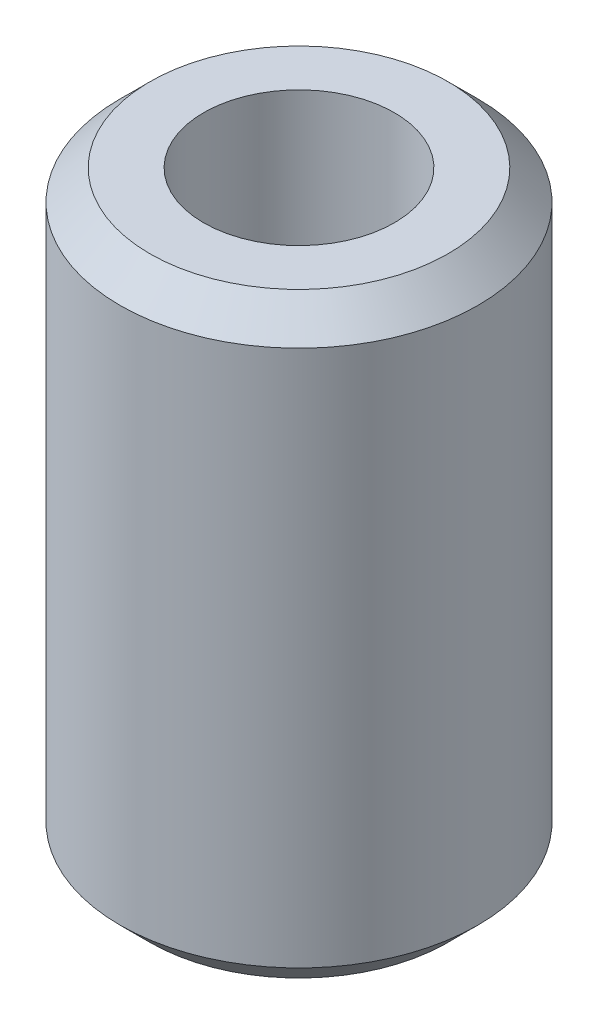
ISO-10303-21;
HEADER;
FILE_DESCRIPTION(('STEP AP214'),'2;1');
FILE_NAME('part.step','',(''),(''),'','','');
FILE_SCHEMA(('AUTOMOTIVE_DESIGN { 1 0 10303 214 1 1 1 1 }'));
ENDSEC;
DATA;
#1=APPLICATION_CONTEXT('core data for automotive mechanical design processes');
#2=APPLICATION_PROTOCOL_DEFINITION('international standard','automotive_design',2000,#1);
#3=PRODUCT_CONTEXT('',#1,'mechanical');
#4=PRODUCT('Part','Part','',(#3));
#5=PRODUCT_RELATED_PRODUCT_CATEGORY('part','',(#4));
#6=PRODUCT_DEFINITION_FORMATION('','',#4);
#7=PRODUCT_DEFINITION_CONTEXT('part definition',#1,'design');
#8=PRODUCT_DEFINITION('design','',#6,#7);
#9=PRODUCT_DEFINITION_SHAPE('','',#8);
#10=(LENGTH_UNIT() NAMED_UNIT(*) SI_UNIT(.MILLI.,.METRE.));
#11=(NAMED_UNIT(*) PLANE_ANGLE_UNIT() SI_UNIT($,.RADIAN.));
#12=(NAMED_UNIT(*) SI_UNIT($,.STERADIAN.) SOLID_ANGLE_UNIT());
#13=UNCERTAINTY_MEASURE_WITH_UNIT(LENGTH_MEASURE(1.E-05),#10,'distance_accuracy_value','');
#14=(GEOMETRIC_REPRESENTATION_CONTEXT(3) GLOBAL_UNCERTAINTY_ASSIGNED_CONTEXT((#13)) GLOBAL_UNIT_ASSIGNED_CONTEXT((#10,
#11,#12)) REPRESENTATION_CONTEXT('',''));
#15=CARTESIAN_POINT('',(0.,0.,0.));
#16=DIRECTION('',(0.,0.,1.));
#17=DIRECTION('',(1.,0.,0.));
#18=AXIS2_PLACEMENT_3D('',#15,#16,#17);
#19=CARTESIAN_POINT('',(0.,10.,0.));
#20=DIRECTION('',(0.,-1.,0.));
#21=DIRECTION('',(0.,0.,-1.));
#22=AXIS2_PLACEMENT_3D('',#19,#20,#21);
#23=CYLINDRICAL_SURFACE('',#22,3.);
#24=CARTESIAN_POINT('',(0.,0.499999999999999,0.));
#25=DIRECTION('',(0.,1.,0.));
#26=DIRECTION('',(0.,0.,1.));
#27=AXIS2_PLACEMENT_3D('',#24,#25,#26);
#28=CIRCLE('',#27,3.);
#29=CARTESIAN_POINT('',(0.,0.499999999999999,3.));
#30=VERTEX_POINT('',#29);
#31=EDGE_CURVE('E42',#30,#30,#28,.T.);
#32=ORIENTED_EDGE('',*,*,#31,.T.);
#33=EDGE_LOOP('',(#32));
#34=FACE_BOUND('',#33,.T.);
#35=CARTESIAN_POINT('',(0.,9.5,0.));
#36=DIRECTION('',(0.,1.,0.));
#37=DIRECTION('',(0.,0.,1.));
#38=AXIS2_PLACEMENT_3D('',#35,#36,#37);
#39=CIRCLE('',#38,3.);
#40=CARTESIAN_POINT('',(0.,9.5,3.));
#41=VERTEX_POINT('',#40);
#42=EDGE_CURVE('E46',#41,#41,#39,.F.);
#43=ORIENTED_EDGE('',*,*,#42,.T.);
#44=EDGE_LOOP('',(#43));
#45=FACE_BOUND('',#44,.T.);
#46=ADVANCED_FACE('F31',(#34,#45),#23,.T.);
#47=CARTESIAN_POINT('',(0.,10.,0.));
#48=DIRECTION('',(0.,1.,0.));
#49=DIRECTION('',(0.,0.,1.));
#50=AXIS2_PLACEMENT_3D('',#47,#48,#49);
#51=PLANE('',#50);
#52=CARTESIAN_POINT('',(0.,10.,0.));
#53=DIRECTION('',(0.,1.,0.));
#54=DIRECTION('',(0.,0.,1.));
#55=AXIS2_PLACEMENT_3D('',#52,#53,#54);
#56=CIRCLE('',#55,2.5);
#57=CARTESIAN_POINT('',(0.,10.,2.5));
#58=VERTEX_POINT('',#57);
#59=EDGE_CURVE('E10',#58,#58,#56,.T.);
#60=ORIENTED_EDGE('',*,*,#59,.T.);
#61=EDGE_LOOP('',(#60));
#62=FACE_BOUND('',#61,.T.);
#63=CARTESIAN_POINT('',(0.,10.,0.));
#64=DIRECTION('',(0.,1.,0.));
#65=DIRECTION('',(0.,0.,1.));
#66=AXIS2_PLACEMENT_3D('',#63,#64,#65);
#67=CIRCLE('',#66,1.6);
#68=CARTESIAN_POINT('',(0.,10.,1.6));
#69=VERTEX_POINT('',#68);
#70=EDGE_CURVE('E52',#69,#69,#67,.T.);
#71=ORIENTED_EDGE('',*,*,#70,.F.);
#72=EDGE_LOOP('',(#71));
#73=FACE_BOUND('',#72,.T.);
#74=ADVANCED_FACE('F67',(#62,#73),#51,.T.);
#75=CARTESIAN_POINT('',(0.,0.,0.));
#76=DIRECTION('',(0.,1.,0.));
#77=DIRECTION('',(0.,0.,1.));
#78=AXIS2_PLACEMENT_3D('',#75,#76,#77);
#79=PLANE('',#78);
#80=CARTESIAN_POINT('',(0.,0.,0.));
#81=DIRECTION('',(0.,1.,0.));
#82=DIRECTION('',(0.,0.,1.));
#83=AXIS2_PLACEMENT_3D('',#80,#81,#82);
#84=CIRCLE('',#83,2.5);
#85=CARTESIAN_POINT('',(0.,0.,2.5));
#86=VERTEX_POINT('',#85);
#87=EDGE_CURVE('E38',#86,#86,#84,.F.);
#88=ORIENTED_EDGE('',*,*,#87,.T.);
#89=EDGE_LOOP('',(#88));
#90=FACE_BOUND('',#89,.T.);
#91=CARTESIAN_POINT('',(0.,0.,0.));
#92=DIRECTION('',(0.,1.,0.));
#93=DIRECTION('',(0.,0.,1.));
#94=AXIS2_PLACEMENT_3D('',#91,#92,#93);
#95=CIRCLE('',#94,1.6);
#96=CARTESIAN_POINT('',(0.,0.,1.6));
#97=VERTEX_POINT('',#96);
#98=EDGE_CURVE('E51',#97,#97,#95,.T.);
#99=ORIENTED_EDGE('',*,*,#98,.T.);
#100=EDGE_LOOP('',(#99));
#101=FACE_BOUND('',#100,.T.);
#102=ADVANCED_FACE('F58',(#90,#101),#79,.F.);
#103=CARTESIAN_POINT('',(0.,0.,0.));
#104=DIRECTION('',(0.,1.,0.));
#105=DIRECTION('',(0.,0.,1.));
#106=AXIS2_PLACEMENT_3D('',#103,#104,#105);
#107=CYLINDRICAL_SURFACE('',#106,1.6);
#108=ORIENTED_EDGE('',*,*,#98,.F.);
#109=EDGE_LOOP('',(#108));
#110=FACE_BOUND('',#109,.T.);
#111=ORIENTED_EDGE('',*,*,#70,.T.);
#112=EDGE_LOOP('',(#111));
#113=FACE_BOUND('',#112,.T.);
#114=ADVANCED_FACE('F60',(#110,#113),#107,.F.);
#115=CARTESIAN_POINT('',(0.,0.499999999999999,0.));
#116=DIRECTION('',(0.,1.,0.));
#117=DIRECTION('',(0.,0.,1.));
#118=AXIS2_PLACEMENT_3D('',#115,#116,#117);
#119=CONICAL_SURFACE('',#118,3.,0.785398163397451);
#120=ORIENTED_EDGE('',*,*,#87,.F.);
#121=EDGE_LOOP('',(#120));
#122=FACE_BOUND('',#121,.T.);
#123=ORIENTED_EDGE('',*,*,#31,.F.);
#124=EDGE_LOOP('',(#123));
#125=FACE_BOUND('',#124,.T.);
#126=ADVANCED_FACE('F63',(#122,#125),#119,.T.);
#127=CARTESIAN_POINT('',(0.,10.,0.));
#128=DIRECTION('',(0.,-1.,0.));
#129=DIRECTION('',(0.,0.,-1.));
#130=AXIS2_PLACEMENT_3D('',#127,#128,#129);
#131=CONICAL_SURFACE('',#130,2.5,0.785398163397448);
#132=ORIENTED_EDGE('',*,*,#42,.F.);
#133=EDGE_LOOP('',(#132));
#134=FACE_BOUND('',#133,.T.);
#135=ORIENTED_EDGE('',*,*,#59,.F.);
#136=EDGE_LOOP('',(#135));
#137=FACE_BOUND('',#136,.T.);
#138=ADVANCED_FACE('F33',(#134,#137),#131,.T.);
#139=CLOSED_SHELL('',(#46,#74,#102,#114,#126,#138));
#140=MANIFOLD_SOLID_BREP('B2',#139);
#141=ADVANCED_BREP_SHAPE_REPRESENTATION('',(#18,#140),#14);
#142=SHAPE_DEFINITION_REPRESENTATION(#9,#141);
ENDSEC;
END-ISO-10303-21;
